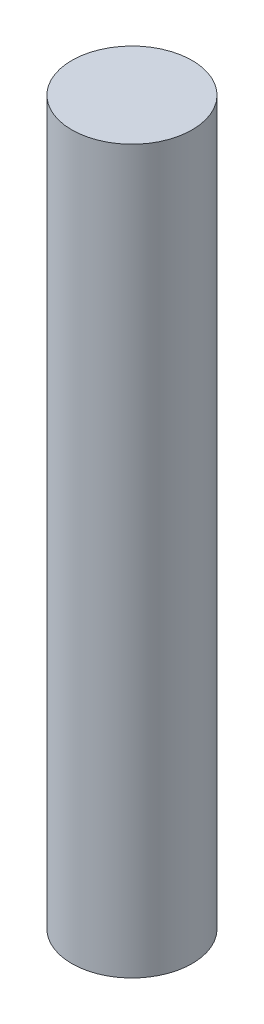
ISO-10303-21;
HEADER;
FILE_DESCRIPTION(('STEP AP214'),'2;1');
FILE_NAME('part.step','',(''),(''),'','','');
FILE_SCHEMA(('AUTOMOTIVE_DESIGN { 1 0 10303 214 1 1 1 1 }'));
ENDSEC;
DATA;
#1=APPLICATION_CONTEXT('core data for automotive mechanical design processes');
#2=APPLICATION_PROTOCOL_DEFINITION('international standard','automotive_design',2000,#1);
#3=PRODUCT_CONTEXT('',#1,'mechanical');
#4=PRODUCT('Part','Part','',(#3));
#5=PRODUCT_RELATED_PRODUCT_CATEGORY('part','',(#4));
#6=PRODUCT_DEFINITION_FORMATION('','',#4);
#7=PRODUCT_DEFINITION_CONTEXT('part definition',#1,'design');
#8=PRODUCT_DEFINITION('design','',#6,#7);
#9=PRODUCT_DEFINITION_SHAPE('','',#8);
#10=(LENGTH_UNIT() NAMED_UNIT(*) SI_UNIT(.MILLI.,.METRE.));
#11=(NAMED_UNIT(*) PLANE_ANGLE_UNIT() SI_UNIT($,.RADIAN.));
#12=(NAMED_UNIT(*) SI_UNIT($,.STERADIAN.) SOLID_ANGLE_UNIT());
#13=UNCERTAINTY_MEASURE_WITH_UNIT(LENGTH_MEASURE(1.E-05),#10,'distance_accuracy_value','');
#14=(GEOMETRIC_REPRESENTATION_CONTEXT(3) GLOBAL_UNCERTAINTY_ASSIGNED_CONTEXT((#13)) GLOBAL_UNIT_ASSIGNED_CONTEXT((#10,
#11,#12)) REPRESENTATION_CONTEXT('',''));
#15=CARTESIAN_POINT('',(0.,0.,0.));
#16=DIRECTION('',(0.,0.,1.));
#17=DIRECTION('',(1.,0.,0.));
#18=AXIS2_PLACEMENT_3D('',#15,#16,#17);
#19=CARTESIAN_POINT('',(0.,30.,0.));
#20=DIRECTION('',(0.,-1.,0.));
#21=DIRECTION('',(0.,0.,-1.));
#22=AXIS2_PLACEMENT_3D('',#19,#20,#21);
#23=CYLINDRICAL_SURFACE('',#22,2.5);
#24=CARTESIAN_POINT('',(0.,30.,0.));
#25=DIRECTION('',(0.,1.,0.));
#26=DIRECTION('',(0.,0.,1.));
#27=AXIS2_PLACEMENT_3D('',#24,#25,#26);
#28=CIRCLE('',#27,2.5);
#29=CARTESIAN_POINT('',(0.,30.,2.5));
#30=VERTEX_POINT('',#29);
#31=EDGE_CURVE('E10',#30,#30,#28,.T.);
#32=ORIENTED_EDGE('',*,*,#31,.F.);
#33=EDGE_LOOP('',(#32));
#34=FACE_BOUND('',#33,.T.);
#35=CARTESIAN_POINT('',(0.,0.,0.));
#36=DIRECTION('',(0.,1.,0.));
#37=DIRECTION('',(0.,0.,1.));
#38=AXIS2_PLACEMENT_3D('',#35,#36,#37);
#39=CIRCLE('',#38,2.5);
#40=CARTESIAN_POINT('',(0.,0.,2.5));
#41=VERTEX_POINT('',#40);
#42=EDGE_CURVE('E34',#41,#41,#39,.T.);
#43=ORIENTED_EDGE('',*,*,#42,.T.);
#44=EDGE_LOOP('',(#43));
#45=FACE_BOUND('',#44,.T.);
#46=ADVANCED_FACE('F31',(#34,#45),#23,.T.);
#47=CARTESIAN_POINT('',(0.,30.,0.));
#48=DIRECTION('',(0.,1.,0.));
#49=DIRECTION('',(0.,0.,1.));
#50=AXIS2_PLACEMENT_3D('',#47,#48,#49);
#51=PLANE('',#50);
#52=ORIENTED_EDGE('',*,*,#31,.T.);
#53=EDGE_LOOP('',(#52));
#54=FACE_BOUND('',#53,.T.);
#55=ADVANCED_FACE('F46',(#54),#51,.T.);
#56=CARTESIAN_POINT('',(0.,0.,0.));
#57=DIRECTION('',(0.,1.,0.));
#58=DIRECTION('',(0.,0.,1.));
#59=AXIS2_PLACEMENT_3D('',#56,#57,#58);
#60=PLANE('',#59);
#61=ORIENTED_EDGE('',*,*,#42,.F.);
#62=EDGE_LOOP('',(#61));
#63=FACE_BOUND('',#62,.T.);
#64=ADVANCED_FACE('F44',(#63),#60,.F.);
#65=CLOSED_SHELL('',(#46,#55,#64));
#66=MANIFOLD_SOLID_BREP('B2',#65);
#67=ADVANCED_BREP_SHAPE_REPRESENTATION('',(#18,#66),#14);
#68=SHAPE_DEFINITION_REPRESENTATION(#9,#67);
ENDSEC;
END-ISO-10303-21;
